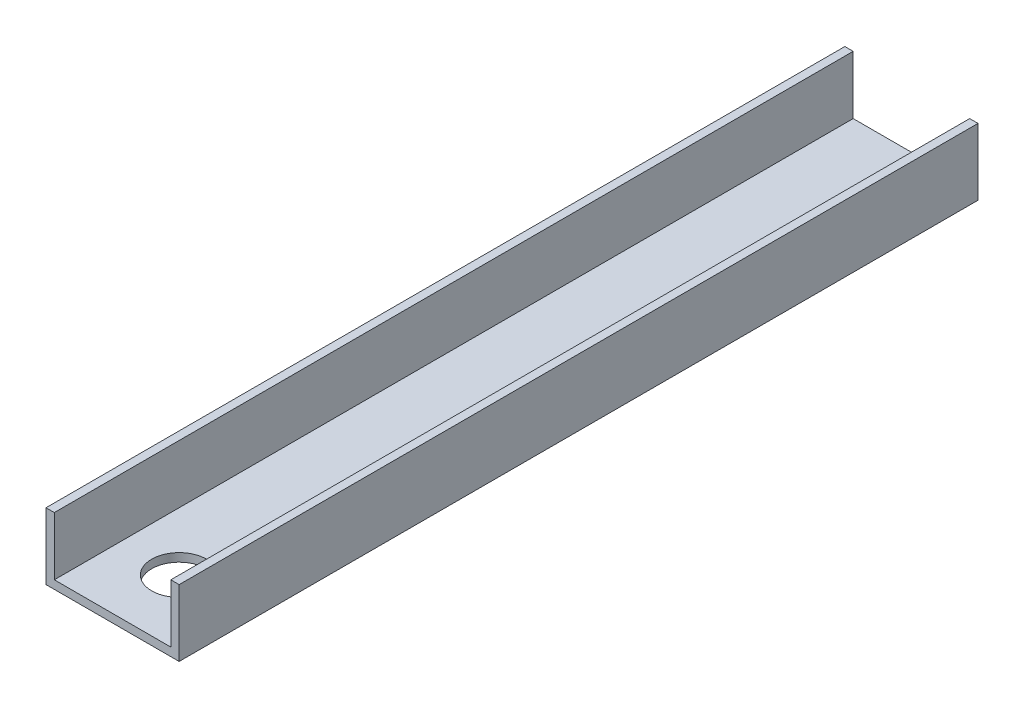
ISO-10303-21;
HEADER;
FILE_DESCRIPTION(('STEP AP214'),'2;1');
FILE_NAME('part.step','',(''),(''),'','','');
FILE_SCHEMA(('AUTOMOTIVE_DESIGN { 1 0 10303 214 1 1 1 1 }'));
ENDSEC;
DATA;
#1=APPLICATION_CONTEXT('core data for automotive mechanical design processes');
#2=APPLICATION_PROTOCOL_DEFINITION('international standard','automotive_design',2000,#1);
#3=PRODUCT_CONTEXT('',#1,'mechanical');
#4=PRODUCT('Part','Part','',(#3));
#5=PRODUCT_RELATED_PRODUCT_CATEGORY('part','',(#4));
#6=PRODUCT_DEFINITION_FORMATION('','',#4);
#7=PRODUCT_DEFINITION_CONTEXT('part definition',#1,'design');
#8=PRODUCT_DEFINITION('design','',#6,#7);
#9=PRODUCT_DEFINITION_SHAPE('','',#8);
#10=(LENGTH_UNIT() NAMED_UNIT(*) SI_UNIT(.MILLI.,.METRE.));
#11=(NAMED_UNIT(*) PLANE_ANGLE_UNIT() SI_UNIT($,.RADIAN.));
#12=(NAMED_UNIT(*) SI_UNIT($,.STERADIAN.) SOLID_ANGLE_UNIT());
#13=UNCERTAINTY_MEASURE_WITH_UNIT(LENGTH_MEASURE(1.E-05),#10,'distance_accuracy_value','');
#14=(GEOMETRIC_REPRESENTATION_CONTEXT(3) GLOBAL_UNCERTAINTY_ASSIGNED_CONTEXT((#13)) GLOBAL_UNIT_ASSIGNED_CONTEXT((#10,
#11,#12)) REPRESENTATION_CONTEXT('',''));
#15=CARTESIAN_POINT('',(0.,0.,0.));
#16=DIRECTION('',(0.,0.,1.));
#17=DIRECTION('',(1.,0.,0.));
#18=AXIS2_PLACEMENT_3D('',#15,#16,#17);
#19=CARTESIAN_POINT('',(0.,25.4,304.8));
#20=DIRECTION('',(0.,-1.,0.));
#21=DIRECTION('',(0.,0.,-1.));
#22=AXIS2_PLACEMENT_3D('',#19,#20,#21);
#23=PLANE('',#22);
#24=DIRECTION('',(-1.,0.,0.));
#25=VECTOR('',#24,1.);
#26=CARTESIAN_POINT('',(0.,25.4,0.));
#27=LINE('',#26,#25);
#28=CARTESIAN_POINT('',(50.8,25.4,0.));
#29=VERTEX_POINT('',#28);
#30=CARTESIAN_POINT('',(47.625,25.4,0.));
#31=VERTEX_POINT('',#30);
#32=EDGE_CURVE('E164',#29,#31,#27,.T.);
#33=ORIENTED_EDGE('',*,*,#32,.T.);
#34=DIRECTION('',(0.,0.,-1.));
#35=VECTOR('',#34,1.);
#36=CARTESIAN_POINT('',(47.625,25.4,304.8));
#37=LINE('',#36,#35);
#38=CARTESIAN_POINT('',(47.625,25.4,304.8));
#39=VERTEX_POINT('',#38);
#40=EDGE_CURVE('E152',#39,#31,#37,.T.);
#41=ORIENTED_EDGE('',*,*,#40,.F.);
#42=DIRECTION('',(-1.,0.,0.));
#43=VECTOR('',#42,1.);
#44=CARTESIAN_POINT('',(0.,25.4,304.8));
#45=LINE('',#44,#43);
#46=CARTESIAN_POINT('',(50.8,25.4,304.8));
#47=VERTEX_POINT('',#46);
#48=EDGE_CURVE('E134',#47,#39,#45,.T.);
#49=ORIENTED_EDGE('',*,*,#48,.F.);
#50=DIRECTION('',(0.,0.,-1.));
#51=VECTOR('',#50,1.);
#52=CARTESIAN_POINT('',(50.8,25.4,304.8));
#53=LINE('',#52,#51);
#54=EDGE_CURVE('E187',#47,#29,#53,.T.);
#55=ORIENTED_EDGE('',*,*,#54,.T.);
#56=EDGE_LOOP('',(#33,#41,#49,#55));
#57=FACE_BOUND('',#56,.T.);
#58=ADVANCED_FACE('F39',(#57),#23,.F.);
#59=CARTESIAN_POINT('',(0.,0.,304.8));
#60=DIRECTION('',(1.,0.,0.));
#61=DIRECTION('',(0.,0.,-1.));
#62=AXIS2_PLACEMENT_3D('',#59,#60,#61);
#63=PLANE('',#62);
#64=DIRECTION('',(0.,-1.,0.));
#65=VECTOR('',#64,1.);
#66=CARTESIAN_POINT('',(0.,0.,0.));
#67=LINE('',#66,#65);
#68=CARTESIAN_POINT('',(0.,25.4,0.));
#69=VERTEX_POINT('',#68);
#70=CARTESIAN_POINT('',(0.,0.,0.));
#71=VERTEX_POINT('',#70);
#72=EDGE_CURVE('E155',#69,#71,#67,.T.);
#73=ORIENTED_EDGE('',*,*,#72,.T.);
#74=DIRECTION('',(0.,0.,-1.));
#75=VECTOR('',#74,1.);
#76=CARTESIAN_POINT('',(0.,0.,304.8));
#77=LINE('',#76,#75);
#78=CARTESIAN_POINT('',(0.,0.,304.8));
#79=VERTEX_POINT('',#78);
#80=EDGE_CURVE('E11',#79,#71,#77,.T.);
#81=ORIENTED_EDGE('',*,*,#80,.F.);
#82=DIRECTION('',(0.,-1.,0.));
#83=VECTOR('',#82,1.);
#84=CARTESIAN_POINT('',(0.,0.,304.8));
#85=LINE('',#84,#83);
#86=CARTESIAN_POINT('',(0.,25.4,304.8));
#87=VERTEX_POINT('',#86);
#88=EDGE_CURVE('E161',#87,#79,#85,.T.);
#89=ORIENTED_EDGE('',*,*,#88,.F.);
#90=DIRECTION('',(0.,0.,-1.));
#91=VECTOR('',#90,1.);
#92=CARTESIAN_POINT('',(0.,25.4,304.8));
#93=LINE('',#92,#91);
#94=EDGE_CURVE('E172',#87,#69,#93,.T.);
#95=ORIENTED_EDGE('',*,*,#94,.T.);
#96=EDGE_LOOP('',(#73,#81,#89,#95));
#97=FACE_BOUND('',#96,.T.);
#98=ADVANCED_FACE('F41',(#97),#63,.F.);
#99=CARTESIAN_POINT('',(0.,0.,304.8));
#100=DIRECTION('',(0.,1.,0.));
#101=DIRECTION('',(0.,0.,1.));
#102=AXIS2_PLACEMENT_3D('',#99,#100,#101);
#103=PLANE('',#102);
#104=CARTESIAN_POINT('',(25.4,0.,279.4));
#105=DIRECTION('',(0.,1.,0.));
#106=DIRECTION('',(0.,0.,1.));
#107=AXIS2_PLACEMENT_3D('',#104,#105,#106);
#108=CIRCLE('',#107,10.4775);
#109=CARTESIAN_POINT('',(25.4,0.,289.8775));
#110=VERTEX_POINT('',#109);
#111=EDGE_CURVE('E149',#110,#110,#108,.T.);
#112=ORIENTED_EDGE('',*,*,#111,.T.);
#113=EDGE_LOOP('',(#112));
#114=FACE_BOUND('',#113,.T.);
#115=DIRECTION('',(1.,0.,0.));
#116=VECTOR('',#115,1.);
#117=CARTESIAN_POINT('',(0.,0.,0.));
#118=LINE('',#117,#116);
#119=CARTESIAN_POINT('',(50.8,0.,0.));
#120=VERTEX_POINT('',#119);
#121=EDGE_CURVE('E176',#71,#120,#118,.T.);
#122=ORIENTED_EDGE('',*,*,#121,.T.);
#123=DIRECTION('',(0.,0.,-1.));
#124=VECTOR('',#123,1.);
#125=CARTESIAN_POINT('',(50.8,0.,304.8));
#126=LINE('',#125,#124);
#127=CARTESIAN_POINT('',(50.8,0.,304.8));
#128=VERTEX_POINT('',#127);
#129=EDGE_CURVE('E48',#128,#120,#126,.T.);
#130=ORIENTED_EDGE('',*,*,#129,.F.);
#131=DIRECTION('',(1.,0.,0.));
#132=VECTOR('',#131,1.);
#133=CARTESIAN_POINT('',(0.,0.,304.8));
#134=LINE('',#133,#132);
#135=EDGE_CURVE('E93',#79,#128,#134,.T.);
#136=ORIENTED_EDGE('',*,*,#135,.F.);
#137=ORIENTED_EDGE('',*,*,#80,.T.);
#138=EDGE_LOOP('',(#122,#130,#136,#137));
#139=FACE_BOUND('',#138,.T.);
#140=ADVANCED_FACE('F208',(#114,#139),#103,.F.);
#141=CARTESIAN_POINT('',(50.8,0.,304.8));
#142=DIRECTION('',(-1.,0.,0.));
#143=DIRECTION('',(0.,0.,1.));
#144=AXIS2_PLACEMENT_3D('',#141,#142,#143);
#145=PLANE('',#144);
#146=DIRECTION('',(0.,1.,0.));
#147=VECTOR('',#146,1.);
#148=CARTESIAN_POINT('',(50.8,0.,0.));
#149=LINE('',#148,#147);
#150=EDGE_CURVE('E179',#120,#29,#149,.T.);
#151=ORIENTED_EDGE('',*,*,#150,.T.);
#152=ORIENTED_EDGE('',*,*,#54,.F.);
#153=DIRECTION('',(0.,1.,0.));
#154=VECTOR('',#153,1.);
#155=CARTESIAN_POINT('',(50.8,0.,304.8));
#156=LINE('',#155,#154);
#157=EDGE_CURVE('E167',#128,#47,#156,.T.);
#158=ORIENTED_EDGE('',*,*,#157,.F.);
#159=ORIENTED_EDGE('',*,*,#129,.T.);
#160=EDGE_LOOP('',(#151,#152,#158,#159));
#161=FACE_BOUND('',#160,.T.);
#162=ADVANCED_FACE('F195',(#161),#145,.F.);
#163=CARTESIAN_POINT('',(3.175,25.4,304.8));
#164=VERTEX_POINT('',#163);
#165=EDGE_CURVE('E64',#164,#87,#45,.T.);
#166=ORIENTED_EDGE('',*,*,#165,.F.);
#167=DIRECTION('',(0.,0.,-1.));
#168=VECTOR('',#167,1.);
#169=CARTESIAN_POINT('',(3.175,25.4,304.8));
#170=LINE('',#169,#168);
#171=CARTESIAN_POINT('',(3.175,25.4,0.));
#172=VERTEX_POINT('',#171);
#173=EDGE_CURVE('E156',#164,#172,#170,.T.);
#174=ORIENTED_EDGE('',*,*,#173,.T.);
#175=EDGE_CURVE('E86',#172,#69,#27,.T.);
#176=ORIENTED_EDGE('',*,*,#175,.T.);
#177=ORIENTED_EDGE('',*,*,#94,.F.);
#178=EDGE_LOOP('',(#166,#174,#176,#177));
#179=FACE_BOUND('',#178,.T.);
#180=ADVANCED_FACE('F204',(#179),#23,.F.);
#181=CARTESIAN_POINT('',(0.,0.,304.8));
#182=DIRECTION('',(0.,0.,-1.));
#183=DIRECTION('',(-1.,0.,0.));
#184=AXIS2_PLACEMENT_3D('',#181,#182,#183);
#185=PLANE('',#184);
#186=ORIENTED_EDGE('',*,*,#48,.T.);
#187=DIRECTION('',(0.,-1.,0.));
#188=VECTOR('',#187,1.);
#189=CARTESIAN_POINT('',(47.625,25.4,304.8));
#190=LINE('',#189,#188);
#191=CARTESIAN_POINT('',(47.625,3.175,304.8));
#192=VERTEX_POINT('',#191);
#193=EDGE_CURVE('E116',#39,#192,#190,.T.);
#194=ORIENTED_EDGE('',*,*,#193,.T.);
#195=DIRECTION('',(-1.,0.,0.));
#196=VECTOR('',#195,1.);
#197=CARTESIAN_POINT('',(47.625,3.175,304.8));
#198=LINE('',#197,#196);
#199=CARTESIAN_POINT('',(3.175,3.175,304.8));
#200=VERTEX_POINT('',#199);
#201=EDGE_CURVE('E126',#192,#200,#198,.T.);
#202=ORIENTED_EDGE('',*,*,#201,.T.);
#203=DIRECTION('',(0.,1.,0.));
#204=VECTOR('',#203,1.);
#205=CARTESIAN_POINT('',(3.175,25.4,304.8));
#206=LINE('',#205,#204);
#207=EDGE_CURVE('E123',#200,#164,#206,.T.);
#208=ORIENTED_EDGE('',*,*,#207,.T.);
#209=ORIENTED_EDGE('',*,*,#165,.T.);
#210=ORIENTED_EDGE('',*,*,#88,.T.);
#211=ORIENTED_EDGE('',*,*,#135,.T.);
#212=ORIENTED_EDGE('',*,*,#157,.T.);
#213=EDGE_LOOP('',(#186,#194,#202,#208,#209,#210,#211,#212));
#214=FACE_BOUND('',#213,.T.);
#215=ADVANCED_FACE('F132',(#214),#185,.F.);
#216=CARTESIAN_POINT('',(0.,0.,0.));
#217=DIRECTION('',(0.,0.,-1.));
#218=DIRECTION('',(-1.,0.,0.));
#219=AXIS2_PLACEMENT_3D('',#216,#217,#218);
#220=PLANE('',#219);
#221=DIRECTION('',(0.,-1.,0.));
#222=VECTOR('',#221,1.);
#223=CARTESIAN_POINT('',(47.625,25.4,0.));
#224=LINE('',#223,#222);
#225=CARTESIAN_POINT('',(47.625,3.175,0.));
#226=VERTEX_POINT('',#225);
#227=EDGE_CURVE('E55',#31,#226,#224,.T.);
#228=ORIENTED_EDGE('',*,*,#227,.F.);
#229=ORIENTED_EDGE('',*,*,#32,.F.);
#230=ORIENTED_EDGE('',*,*,#150,.F.);
#231=ORIENTED_EDGE('',*,*,#121,.F.);
#232=ORIENTED_EDGE('',*,*,#72,.F.);
#233=ORIENTED_EDGE('',*,*,#175,.F.);
#234=DIRECTION('',(0.,1.,0.));
#235=VECTOR('',#234,1.);
#236=CARTESIAN_POINT('',(3.175,25.4,0.));
#237=LINE('',#236,#235);
#238=CARTESIAN_POINT('',(3.175,3.175,0.));
#239=VERTEX_POINT('',#238);
#240=EDGE_CURVE('E136',#239,#172,#237,.T.);
#241=ORIENTED_EDGE('',*,*,#240,.F.);
#242=DIRECTION('',(-1.,0.,0.));
#243=VECTOR('',#242,1.);
#244=CARTESIAN_POINT('',(47.625,3.175,0.));
#245=LINE('',#244,#243);
#246=EDGE_CURVE('E139',#226,#239,#245,.T.);
#247=ORIENTED_EDGE('',*,*,#246,.F.);
#248=EDGE_LOOP('',(#228,#229,#230,#231,#232,#233,#241,#247));
#249=FACE_BOUND('',#248,.T.);
#250=ADVANCED_FACE('F199',(#249),#220,.T.);
#251=CARTESIAN_POINT('',(47.625,25.4,304.8));
#252=DIRECTION('',(1.,0.,0.));
#253=DIRECTION('',(0.,0.,-1.));
#254=AXIS2_PLACEMENT_3D('',#251,#252,#253);
#255=PLANE('',#254);
#256=ORIENTED_EDGE('',*,*,#227,.T.);
#257=DIRECTION('',(0.,0.,-1.));
#258=VECTOR('',#257,1.);
#259=CARTESIAN_POINT('',(47.625,3.175,304.8));
#260=LINE('',#259,#258);
#261=EDGE_CURVE('E112',#192,#226,#260,.T.);
#262=ORIENTED_EDGE('',*,*,#261,.F.);
#263=ORIENTED_EDGE('',*,*,#193,.F.);
#264=ORIENTED_EDGE('',*,*,#40,.T.);
#265=EDGE_LOOP('',(#256,#262,#263,#264));
#266=FACE_BOUND('',#265,.T.);
#267=ADVANCED_FACE('F114',(#266),#255,.F.);
#268=CARTESIAN_POINT('',(3.175,25.4,304.8));
#269=DIRECTION('',(-1.,0.,0.));
#270=DIRECTION('',(0.,0.,1.));
#271=AXIS2_PLACEMENT_3D('',#268,#269,#270);
#272=PLANE('',#271);
#273=ORIENTED_EDGE('',*,*,#240,.T.);
#274=ORIENTED_EDGE('',*,*,#173,.F.);
#275=ORIENTED_EDGE('',*,*,#207,.F.);
#276=DIRECTION('',(0.,0.,-1.));
#277=VECTOR('',#276,1.);
#278=CARTESIAN_POINT('',(3.175,3.175,304.8));
#279=LINE('',#278,#277);
#280=EDGE_CURVE('E122',#200,#239,#279,.T.);
#281=ORIENTED_EDGE('',*,*,#280,.T.);
#282=EDGE_LOOP('',(#273,#274,#275,#281));
#283=FACE_BOUND('',#282,.T.);
#284=ADVANCED_FACE('F237',(#283),#272,.F.);
#285=CARTESIAN_POINT('',(47.625,3.175,304.8));
#286=DIRECTION('',(0.,-1.,0.));
#287=DIRECTION('',(0.,0.,-1.));
#288=AXIS2_PLACEMENT_3D('',#285,#286,#287);
#289=PLANE('',#288);
#290=CARTESIAN_POINT('',(25.4,3.175,279.4));
#291=DIRECTION('',(0.,1.,0.));
#292=DIRECTION('',(0.,0.,1.));
#293=AXIS2_PLACEMENT_3D('',#290,#291,#292);
#294=CIRCLE('',#293,10.4775);
#295=CARTESIAN_POINT('',(25.4,3.175,289.8775));
#296=VERTEX_POINT('',#295);
#297=EDGE_CURVE('E142',#296,#296,#294,.T.);
#298=ORIENTED_EDGE('',*,*,#297,.F.);
#299=EDGE_LOOP('',(#298));
#300=FACE_BOUND('',#299,.T.);
#301=ORIENTED_EDGE('',*,*,#246,.T.);
#302=ORIENTED_EDGE('',*,*,#280,.F.);
#303=ORIENTED_EDGE('',*,*,#201,.F.);
#304=ORIENTED_EDGE('',*,*,#261,.T.);
#305=EDGE_LOOP('',(#301,#302,#303,#304));
#306=FACE_BOUND('',#305,.T.);
#307=ADVANCED_FACE('F127',(#300,#306),#289,.F.);
#308=CARTESIAN_POINT('',(25.4,0.,279.4));
#309=DIRECTION('',(0.,1.,0.));
#310=DIRECTION('',(0.,0.,1.));
#311=AXIS2_PLACEMENT_3D('',#308,#309,#310);
#312=CYLINDRICAL_SURFACE('',#311,10.4775);
#313=ORIENTED_EDGE('',*,*,#111,.F.);
#314=EDGE_LOOP('',(#313));
#315=FACE_BOUND('',#314,.T.);
#316=ORIENTED_EDGE('',*,*,#297,.T.);
#317=EDGE_LOOP('',(#316));
#318=FACE_BOUND('',#317,.T.);
#319=ADVANCED_FACE('F234',(#315,#318),#312,.F.);
#320=CLOSED_SHELL('',(#58,#98,#140,#162,#180,#215,#250,#267,#284,#307,#319));
#321=MANIFOLD_SOLID_BREP('B2',#320);
#322=ADVANCED_BREP_SHAPE_REPRESENTATION('',(#18,#321),#14);
#323=SHAPE_DEFINITION_REPRESENTATION(#9,#322);
ENDSEC;
END-ISO-10303-21;
